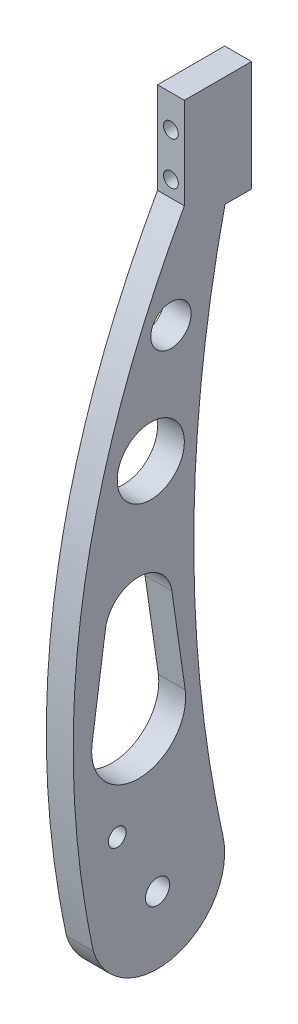
ISO-10303-21;
HEADER;
FILE_DESCRIPTION(('STEP AP214'),'2;1');
FILE_NAME('part.step','',(''),(''),'','','');
FILE_SCHEMA(('AUTOMOTIVE_DESIGN { 1 0 10303 214 1 1 1 1 }'));
ENDSEC;
DATA;
#1=APPLICATION_CONTEXT('core data for automotive mechanical design processes');
#2=APPLICATION_PROTOCOL_DEFINITION('international standard','automotive_design',2000,#1);
#3=PRODUCT_CONTEXT('',#1,'mechanical');
#4=PRODUCT('Part','Part','',(#3));
#5=PRODUCT_RELATED_PRODUCT_CATEGORY('part','',(#4));
#6=PRODUCT_DEFINITION_FORMATION('','',#4);
#7=PRODUCT_DEFINITION_CONTEXT('part definition',#1,'design');
#8=PRODUCT_DEFINITION('design','',#6,#7);
#9=PRODUCT_DEFINITION_SHAPE('','',#8);
#10=(LENGTH_UNIT() NAMED_UNIT(*) SI_UNIT(.MILLI.,.METRE.));
#11=(NAMED_UNIT(*) PLANE_ANGLE_UNIT() SI_UNIT($,.RADIAN.));
#12=(NAMED_UNIT(*) SI_UNIT($,.STERADIAN.) SOLID_ANGLE_UNIT());
#13=UNCERTAINTY_MEASURE_WITH_UNIT(LENGTH_MEASURE(1.E-05),#10,'distance_accuracy_value','');
#14=(GEOMETRIC_REPRESENTATION_CONTEXT(3) GLOBAL_UNCERTAINTY_ASSIGNED_CONTEXT((#13)) GLOBAL_UNIT_ASSIGNED_CONTEXT((#10,
#11,#12)) REPRESENTATION_CONTEXT('',''));
#15=CARTESIAN_POINT('',(0.,0.,0.));
#16=DIRECTION('',(0.,0.,1.));
#17=DIRECTION('',(1.,0.,0.));
#18=AXIS2_PLACEMENT_3D('',#15,#16,#17);
#19=CARTESIAN_POINT('',(0.,107.239018535757,27.9707283899343));
#20=DIRECTION('',(1.,0.,0.));
#21=DIRECTION('',(0.,0.,-1.));
#22=AXIS2_PLACEMENT_3D('',#19,#20,#21);
#23=PLANE('',#22);
#24=CARTESIAN_POINT('',(0.,0.,0.));
#25=DIRECTION('',(1.,0.,0.));
#26=DIRECTION('',(0.,0.,-1.));
#27=AXIS2_PLACEMENT_3D('',#24,#25,#26);
#28=CIRCLE('',#27,4.49999999999999);
#29=CARTESIAN_POINT('',(0.,0.,-4.49999999999999));
#30=VERTEX_POINT('',#29);
#31=EDGE_CURVE('E301',#30,#30,#28,.T.);
#32=ORIENTED_EDGE('',*,*,#31,.T.);
#33=EDGE_LOOP('',(#32));
#34=FACE_BOUND('',#33,.T.);
#35=DIRECTION('',(0.,0.,1.));
#36=VECTOR('',#35,1.);
#37=CARTESIAN_POINT('',(0.,250.,-10.));
#38=LINE('',#37,#36);
#39=CARTESIAN_POINT('',(0.,250.,-35.));
#40=VERTEX_POINT('',#39);
#41=CARTESIAN_POINT('',(0.,250.,-10.));
#42=VERTEX_POINT('',#41);
#43=EDGE_CURVE('E136',#40,#42,#38,.T.);
#44=ORIENTED_EDGE('',*,*,#43,.F.);
#45=DIRECTION('',(0.,1.,0.));
#46=VECTOR('',#45,1.);
#47=CARTESIAN_POINT('',(0.,208.897946032526,-35.));
#48=LINE('',#47,#46);
#49=CARTESIAN_POINT('',(0.,208.897946032526,-35.));
#50=VERTEX_POINT('',#49);
#51=EDGE_CURVE('E163',#50,#40,#48,.T.);
#52=ORIENTED_EDGE('',*,*,#51,.F.);
#53=DIRECTION('',(0.,0.,-1.));
#54=VECTOR('',#53,1.);
#55=CARTESIAN_POINT('',(0.,208.897946032526,-25.1229643170488));
#56=LINE('',#55,#54);
#57=CARTESIAN_POINT('',(0.,208.897946032526,-25.1229643170489));
#58=VERTEX_POINT('',#57);
#59=EDGE_CURVE('E229',#58,#50,#56,.T.);
#60=ORIENTED_EDGE('',*,*,#59,.F.);
#61=CARTESIAN_POINT('',(0.,105.556538038676,-478.94465908181));
#62=DIRECTION('',(-1.,0.,0.));
#63=DIRECTION('',(0.,0.,1.));
#64=AXIS2_PLACEMENT_3D('',#61,#62,#63);
#65=CIRCLE('',#64,465.439123028256);
#66=CARTESIAN_POINT('',(0.,5.51026983738115,-24.3851784147512));
#67=VERTEX_POINT('',#66);
#68=EDGE_CURVE('E220',#67,#58,#65,.T.);
#69=ORIENTED_EDGE('',*,*,#68,.F.);
#70=CARTESIAN_POINT('',(0.,0.,0.));
#71=DIRECTION('',(1.,0.,0.));
#72=DIRECTION('',(0.,0.,-1.));
#73=AXIS2_PLACEMENT_3D('',#70,#71,#72);
#74=CIRCLE('',#73,25.);
#75=CARTESIAN_POINT('',(0.,-7.32587747634419,23.9025421075164));
#76=VERTEX_POINT('',#75);
#77=EDGE_CURVE('E230',#76,#67,#74,.T.);
#78=ORIENTED_EDGE('',*,*,#77,.F.);
#79=CARTESIAN_POINT('',(0.,215.979685496881,-10.));
#80=CARTESIAN_POINT('',(0.,110.151133061246,48.9901857261103));
#81=CARTESIAN_POINT('',(0.,-7.32587747634419,23.9025421075164));
#82=B_SPLINE_CURVE_WITH_KNOTS('',2,(#79,#80,#81),.UNSPECIFIED.,.F.,.F.,(3,3),(0.,1.),.UNSPECIFIED.);
#83=CARTESIAN_POINT('',(0.,215.979685496881,-10.));
#84=VERTEX_POINT('',#83);
#85=EDGE_CURVE('E257',#84,#76,#82,.T.);
#86=ORIENTED_EDGE('',*,*,#85,.F.);
#87=DIRECTION('',(0.,-1.,0.));
#88=VECTOR('',#87,1.);
#89=CARTESIAN_POINT('',(0.,215.979685496881,-10.));
#90=LINE('',#89,#88);
#91=EDGE_CURVE('E261',#42,#84,#90,.T.);
#92=ORIENTED_EDGE('',*,*,#91,.F.);
#93=EDGE_LOOP('',(#44,#52,#60,#69,#78,#86,#92));
#94=FACE_BOUND('',#93,.T.);
#95=CARTESIAN_POINT('',(0.,57.3667162252013,7.01844159044462));
#96=DIRECTION('',(1.,0.,0.));
#97=DIRECTION('',(0.,0.,-1.));
#98=AXIS2_PLACEMENT_3D('',#95,#96,#97);
#99=CIRCLE('',#98,17.5);
#100=CARTESIAN_POINT('',(0.,59.8667162252013,24.3389496661334));
#101=VERTEX_POINT('',#100);
#102=CARTESIAN_POINT('',(0.,59.8667162252013,-10.3020664852442));
#103=VERTEX_POINT('',#102);
#104=EDGE_CURVE('E60',#101,#103,#99,.T.);
#105=ORIENTED_EDGE('',*,*,#104,.T.);
#106=DIRECTION('',(0.,0.989743318610787,0.142857142857143));
#107=VECTOR('',#106,1.);
#108=CARTESIAN_POINT('',(0.,94.1524305109156,-5.35334989219021));
#109=LINE('',#108,#107);
#110=CARTESIAN_POINT('',(0.,94.1524305109156,-5.35334989219021));
#111=VERTEX_POINT('',#110);
#112=EDGE_CURVE('E135',#103,#111,#109,.T.);
#113=ORIENTED_EDGE('',*,*,#112,.T.);
#114=CARTESIAN_POINT('',(0.,92.3667162252013,7.01844159044462));
#115=DIRECTION('',(1.,0.,0.));
#116=DIRECTION('',(0.,0.,-1.));
#117=AXIS2_PLACEMENT_3D('',#114,#115,#116);
#118=CIRCLE('',#117,12.5);
#119=CARTESIAN_POINT('',(0.,94.1524305109156,19.3902330730795));
#120=VERTEX_POINT('',#119);
#121=EDGE_CURVE('E152',#111,#120,#118,.T.);
#122=ORIENTED_EDGE('',*,*,#121,.T.);
#123=DIRECTION('',(0.,-0.989743318610787,0.142857142857143));
#124=VECTOR('',#123,1.);
#125=CARTESIAN_POINT('',(0.,59.8667162252013,24.3389496661334));
#126=LINE('',#125,#124);
#127=EDGE_CURVE('E129',#120,#101,#126,.T.);
#128=ORIENTED_EDGE('',*,*,#127,.T.);
#129=EDGE_LOOP('',(#105,#113,#122,#128));
#130=FACE_BOUND('',#129,.T.);
#131=CARTESIAN_POINT('',(0.,180.,-5.00000000000001));
#132=DIRECTION('',(1.,0.,0.));
#133=DIRECTION('',(0.,0.,-1.));
#134=AXIS2_PLACEMENT_3D('',#131,#132,#133);
#135=CIRCLE('',#134,7.5);
#136=CARTESIAN_POINT('',(0.,180.,-12.5));
#137=VERTEX_POINT('',#136);
#138=EDGE_CURVE('E284',#137,#137,#135,.T.);
#139=ORIENTED_EDGE('',*,*,#138,.T.);
#140=EDGE_LOOP('',(#139));
#141=FACE_BOUND('',#140,.T.);
#142=CARTESIAN_POINT('',(0.,140.,2.5));
#143=DIRECTION('',(1.,0.,0.));
#144=DIRECTION('',(0.,0.,-1.));
#145=AXIS2_PLACEMENT_3D('',#142,#143,#144);
#146=CIRCLE('',#145,12.5);
#147=CARTESIAN_POINT('',(0.,140.,-10.));
#148=VERTEX_POINT('',#147);
#149=EDGE_CURVE('E288',#148,#148,#146,.T.);
#150=ORIENTED_EDGE('',*,*,#149,.T.);
#151=EDGE_LOOP('',(#150));
#152=FACE_BOUND('',#151,.T.);
#153=CARTESIAN_POINT('',(0.,25.,15.));
#154=DIRECTION('',(-1.,0.,0.));
#155=DIRECTION('',(0.,0.,1.));
#156=AXIS2_PLACEMENT_3D('',#153,#154,#155);
#157=CIRCLE('',#156,3.3);
#158=CARTESIAN_POINT('',(0.,25.,18.3));
#159=VERTEX_POINT('',#158);
#160=EDGE_CURVE('E291',#159,#159,#157,.T.);
#161=ORIENTED_EDGE('',*,*,#160,.F.);
#162=EDGE_LOOP('',(#161));
#163=FACE_BOUND('',#162,.T.);
#164=ADVANCED_FACE('F37',(#34,#94,#130,#141,#152,#163),#23,.F.);
#165=CARTESIAN_POINT('',(10.,107.239018535757,27.9707283899343));
#166=DIRECTION('',(1.,0.,0.));
#167=DIRECTION('',(0.,0.,-1.));
#168=AXIS2_PLACEMENT_3D('',#165,#166,#167);
#169=PLANE('',#168);
#170=CARTESIAN_POINT('',(10.,25.,15.));
#171=DIRECTION('',(1.,0.,0.));
#172=DIRECTION('',(0.,0.,-1.));
#173=AXIS2_PLACEMENT_3D('',#170,#171,#172);
#174=CIRCLE('',#173,3.3);
#175=CARTESIAN_POINT('',(10.,25.,11.7));
#176=VERTEX_POINT('',#175);
#177=EDGE_CURVE('E293',#176,#176,#174,.T.);
#178=ORIENTED_EDGE('',*,*,#177,.F.);
#179=EDGE_LOOP('',(#178));
#180=FACE_BOUND('',#179,.T.);
#181=CARTESIAN_POINT('',(10.,0.,0.));
#182=DIRECTION('',(1.,0.,0.));
#183=DIRECTION('',(0.,0.,-1.));
#184=AXIS2_PLACEMENT_3D('',#181,#182,#183);
#185=CIRCLE('',#184,4.49999999999999);
#186=CARTESIAN_POINT('',(10.,0.,-4.49999999999999));
#187=VERTEX_POINT('',#186);
#188=EDGE_CURVE('E296',#187,#187,#185,.T.);
#189=ORIENTED_EDGE('',*,*,#188,.F.);
#190=EDGE_LOOP('',(#189));
#191=FACE_BOUND('',#190,.T.);
#192=CARTESIAN_POINT('',(10.,180.,-5.00000000000001));
#193=DIRECTION('',(1.,0.,0.));
#194=DIRECTION('',(0.,0.,-1.));
#195=AXIS2_PLACEMENT_3D('',#192,#193,#194);
#196=CIRCLE('',#195,7.5);
#197=CARTESIAN_POINT('',(10.,180.,-12.5));
#198=VERTEX_POINT('',#197);
#199=EDGE_CURVE('E150',#198,#198,#196,.T.);
#200=ORIENTED_EDGE('',*,*,#199,.F.);
#201=EDGE_LOOP('',(#200));
#202=FACE_BOUND('',#201,.T.);
#203=DIRECTION('',(0.,0.,1.));
#204=VECTOR('',#203,1.);
#205=CARTESIAN_POINT('',(10.,250.,-35.));
#206=LINE('',#205,#204);
#207=CARTESIAN_POINT('',(10.,250.,-35.));
#208=VERTEX_POINT('',#207);
#209=CARTESIAN_POINT('',(10.,250.,-10.));
#210=VERTEX_POINT('',#209);
#211=EDGE_CURVE('E160',#208,#210,#206,.T.);
#212=ORIENTED_EDGE('',*,*,#211,.T.);
#213=DIRECTION('',(0.,-1.,0.));
#214=VECTOR('',#213,1.);
#215=CARTESIAN_POINT('',(10.,215.979685496881,-10.));
#216=LINE('',#215,#214);
#217=CARTESIAN_POINT('',(10.,215.979685496881,-10.));
#218=VERTEX_POINT('',#217);
#219=EDGE_CURVE('E162',#210,#218,#216,.T.);
#220=ORIENTED_EDGE('',*,*,#219,.T.);
#221=CARTESIAN_POINT('',(10.,215.979685496881,-10.));
#222=CARTESIAN_POINT('',(10.,110.151133061246,48.9901857261103));
#223=CARTESIAN_POINT('',(10.,-7.32587747634419,23.9025421075164));
#224=B_SPLINE_CURVE_WITH_KNOTS('',2,(#221,#222,#223),.UNSPECIFIED.,.F.,.F.,(3,3),(0.,1.),.UNSPECIFIED.);
#225=CARTESIAN_POINT('',(10.,-7.32587747634419,23.9025421075164));
#226=VERTEX_POINT('',#225);
#227=EDGE_CURVE('E165',#218,#226,#224,.T.);
#228=ORIENTED_EDGE('',*,*,#227,.T.);
#229=CARTESIAN_POINT('',(10.,0.,0.));
#230=DIRECTION('',(1.,0.,0.));
#231=DIRECTION('',(0.,0.,-1.));
#232=AXIS2_PLACEMENT_3D('',#229,#230,#231);
#233=CIRCLE('',#232,25.);
#234=CARTESIAN_POINT('',(10.,5.51026983738115,-24.3851784147512));
#235=VERTEX_POINT('',#234);
#236=EDGE_CURVE('E170',#226,#235,#233,.T.);
#237=ORIENTED_EDGE('',*,*,#236,.T.);
#238=CARTESIAN_POINT('',(10.,105.556538038676,-478.94465908181));
#239=DIRECTION('',(-1.,0.,0.));
#240=DIRECTION('',(0.,0.,1.));
#241=AXIS2_PLACEMENT_3D('',#238,#239,#240);
#242=CIRCLE('',#241,465.439123028256);
#243=CARTESIAN_POINT('',(10.,208.897946032526,-25.1229643170489));
#244=VERTEX_POINT('',#243);
#245=EDGE_CURVE('E272',#235,#244,#242,.T.);
#246=ORIENTED_EDGE('',*,*,#245,.T.);
#247=DIRECTION('',(0.,0.,-1.));
#248=VECTOR('',#247,1.);
#249=CARTESIAN_POINT('',(10.,208.897946032526,-25.1229643170488));
#250=LINE('',#249,#248);
#251=CARTESIAN_POINT('',(10.,208.897946032526,-35.));
#252=VERTEX_POINT('',#251);
#253=EDGE_CURVE('E234',#244,#252,#250,.T.);
#254=ORIENTED_EDGE('',*,*,#253,.T.);
#255=DIRECTION('',(0.,1.,0.));
#256=VECTOR('',#255,1.);
#257=CARTESIAN_POINT('',(10.,208.897946032526,-35.));
#258=LINE('',#257,#256);
#259=EDGE_CURVE('E247',#252,#208,#258,.T.);
#260=ORIENTED_EDGE('',*,*,#259,.T.);
#261=EDGE_LOOP('',(#212,#220,#228,#237,#246,#254,#260));
#262=FACE_BOUND('',#261,.T.);
#263=DIRECTION('',(0.,0.989743318610787,0.142857142857143));
#264=VECTOR('',#263,1.);
#265=CARTESIAN_POINT('',(10.,94.1524305109156,-5.35334989219021));
#266=LINE('',#265,#264);
#267=CARTESIAN_POINT('',(10.,59.8667162252013,-10.3020664852442));
#268=VERTEX_POINT('',#267);
#269=CARTESIAN_POINT('',(10.,94.1524305109156,-5.35334989219021));
#270=VERTEX_POINT('',#269);
#271=EDGE_CURVE('E128',#268,#270,#266,.T.);
#272=ORIENTED_EDGE('',*,*,#271,.F.);
#273=CARTESIAN_POINT('',(10.,57.3667162252013,7.01844159044462));
#274=DIRECTION('',(1.,0.,0.));
#275=DIRECTION('',(0.,0.,-1.));
#276=AXIS2_PLACEMENT_3D('',#273,#274,#275);
#277=CIRCLE('',#276,17.5);
#278=CARTESIAN_POINT('',(10.,59.8667162252013,24.3389496661334));
#279=VERTEX_POINT('',#278);
#280=EDGE_CURVE('E120',#279,#268,#277,.T.);
#281=ORIENTED_EDGE('',*,*,#280,.F.);
#282=DIRECTION('',(0.,-0.989743318610787,0.142857142857143));
#283=VECTOR('',#282,1.);
#284=CARTESIAN_POINT('',(10.,59.8667162252013,24.3389496661334));
#285=LINE('',#284,#283);
#286=CARTESIAN_POINT('',(10.,94.1524305109156,19.3902330730795));
#287=VERTEX_POINT('',#286);
#288=EDGE_CURVE('E144',#287,#279,#285,.T.);
#289=ORIENTED_EDGE('',*,*,#288,.F.);
#290=CARTESIAN_POINT('',(10.,92.3667162252013,7.01844159044462));
#291=DIRECTION('',(1.,0.,0.));
#292=DIRECTION('',(0.,0.,-1.));
#293=AXIS2_PLACEMENT_3D('',#290,#291,#292);
#294=CIRCLE('',#293,12.5);
#295=EDGE_CURVE('E142',#270,#287,#294,.T.);
#296=ORIENTED_EDGE('',*,*,#295,.F.);
#297=EDGE_LOOP('',(#272,#281,#289,#296));
#298=FACE_BOUND('',#297,.T.);
#299=CARTESIAN_POINT('',(10.,140.,2.5));
#300=DIRECTION('',(1.,0.,0.));
#301=DIRECTION('',(0.,0.,-1.));
#302=AXIS2_PLACEMENT_3D('',#299,#300,#301);
#303=CIRCLE('',#302,12.5);
#304=CARTESIAN_POINT('',(10.,140.,-10.));
#305=VERTEX_POINT('',#304);
#306=EDGE_CURVE('E314',#305,#305,#303,.T.);
#307=ORIENTED_EDGE('',*,*,#306,.F.);
#308=EDGE_LOOP('',(#307));
#309=FACE_BOUND('',#308,.T.);
#310=ADVANCED_FACE('F140',(#180,#191,#202,#262,#298,#309),#169,.T.);
#311=CARTESIAN_POINT('',(10.,250.,-10.));
#312=DIRECTION('',(0.,-1.,0.));
#313=DIRECTION('',(0.,0.,-1.));
#314=AXIS2_PLACEMENT_3D('',#311,#312,#313);
#315=PLANE('',#314);
#316=ORIENTED_EDGE('',*,*,#43,.T.);
#317=DIRECTION('',(-1.,0.,0.));
#318=VECTOR('',#317,1.);
#319=CARTESIAN_POINT('',(10.,250.,-10.));
#320=LINE('',#319,#318);
#321=EDGE_CURVE('E11',#210,#42,#320,.T.);
#322=ORIENTED_EDGE('',*,*,#321,.F.);
#323=ORIENTED_EDGE('',*,*,#211,.F.);
#324=DIRECTION('',(-1.,0.,0.));
#325=VECTOR('',#324,1.);
#326=CARTESIAN_POINT('',(10.,250.,-35.));
#327=LINE('',#326,#325);
#328=EDGE_CURVE('E244',#208,#40,#327,.T.);
#329=ORIENTED_EDGE('',*,*,#328,.T.);
#330=EDGE_LOOP('',(#316,#322,#323,#329));
#331=FACE_BOUND('',#330,.T.);
#332=ADVANCED_FACE('F39',(#331),#315,.F.);
#333=CARTESIAN_POINT('',(10.,215.979685496881,-10.));
#334=DIRECTION('',(0.,0.,-1.));
#335=DIRECTION('',(-1.,0.,0.));
#336=AXIS2_PLACEMENT_3D('',#333,#334,#335);
#337=PLANE('',#336);
#338=CARTESIAN_POINT('',(4.98385200999962,238.,-10.));
#339=DIRECTION('',(0.,0.,-1.));
#340=DIRECTION('',(-1.,0.,0.));
#341=AXIS2_PLACEMENT_3D('',#338,#339,#340);
#342=CIRCLE('',#341,2.74999999999999);
#343=CARTESIAN_POINT('',(2.23385200999963,238.,-10.));
#344=VERTEX_POINT('',#343);
#345=EDGE_CURVE('E306',#344,#344,#342,.T.);
#346=ORIENTED_EDGE('',*,*,#345,.T.);
#347=EDGE_LOOP('',(#346));
#348=FACE_BOUND('',#347,.T.);
#349=CARTESIAN_POINT('',(4.98385200999962,222.,-10.));
#350=DIRECTION('',(0.,0.,-1.));
#351=DIRECTION('',(-1.,0.,0.));
#352=AXIS2_PLACEMENT_3D('',#349,#350,#351);
#353=CIRCLE('',#352,2.74999999999999);
#354=CARTESIAN_POINT('',(2.23385200999963,222.,-10.));
#355=VERTEX_POINT('',#354);
#356=EDGE_CURVE('E311',#355,#355,#353,.T.);
#357=ORIENTED_EDGE('',*,*,#356,.T.);
#358=EDGE_LOOP('',(#357));
#359=FACE_BOUND('',#358,.T.);
#360=ORIENTED_EDGE('',*,*,#91,.T.);
#361=DIRECTION('',(-1.,0.,0.));
#362=VECTOR('',#361,1.);
#363=CARTESIAN_POINT('',(10.,215.979685496881,-10.));
#364=LINE('',#363,#362);
#365=EDGE_CURVE('E45',#218,#84,#364,.T.);
#366=ORIENTED_EDGE('',*,*,#365,.F.);
#367=ORIENTED_EDGE('',*,*,#219,.F.);
#368=ORIENTED_EDGE('',*,*,#321,.T.);
#369=EDGE_LOOP('',(#360,#366,#367,#368));
#370=FACE_BOUND('',#369,.T.);
#371=ADVANCED_FACE('F180',(#348,#359,#370),#337,.F.);
#372=DIRECTION('',(-1.,0.,0.));
#373=VECTOR('',#372,1.);
#374=SURFACE_OF_LINEAR_EXTRUSION('',#224,#373);
#375=ORIENTED_EDGE('',*,*,#85,.T.);
#376=DIRECTION('',(-1.,0.,0.));
#377=VECTOR('',#376,1.);
#378=CARTESIAN_POINT('',(10.,-7.32587747634419,23.9025421075164));
#379=LINE('',#378,#377);
#380=EDGE_CURVE('E250',#226,#76,#379,.T.);
#381=ORIENTED_EDGE('',*,*,#380,.F.);
#382=ORIENTED_EDGE('',*,*,#227,.F.);
#383=ORIENTED_EDGE('',*,*,#365,.T.);
#384=EDGE_LOOP('',(#375,#381,#382,#383));
#385=FACE_BOUND('',#384,.T.);
#386=ADVANCED_FACE('F176',(#385),#374,.F.);
#387=CARTESIAN_POINT('',(10.,0.,0.));
#388=DIRECTION('',(-1.,0.,0.));
#389=DIRECTION('',(0.,0.,1.));
#390=AXIS2_PLACEMENT_3D('',#387,#388,#389);
#391=CYLINDRICAL_SURFACE('',#390,25.);
#392=ORIENTED_EDGE('',*,*,#77,.T.);
#393=DIRECTION('',(-1.,0.,0.));
#394=VECTOR('',#393,1.);
#395=CARTESIAN_POINT('',(10.,5.51026983738115,-24.3851784147512));
#396=LINE('',#395,#394);
#397=EDGE_CURVE('E226',#235,#67,#396,.T.);
#398=ORIENTED_EDGE('',*,*,#397,.F.);
#399=ORIENTED_EDGE('',*,*,#236,.F.);
#400=ORIENTED_EDGE('',*,*,#380,.T.);
#401=EDGE_LOOP('',(#392,#398,#399,#400));
#402=FACE_BOUND('',#401,.T.);
#403=ADVANCED_FACE('F179',(#402),#391,.T.);
#404=CARTESIAN_POINT('',(10.,105.556538038676,-478.94465908181));
#405=DIRECTION('',(-1.,0.,0.));
#406=DIRECTION('',(0.,0.,1.));
#407=AXIS2_PLACEMENT_3D('',#404,#405,#406);
#408=CYLINDRICAL_SURFACE('',#407,465.439123028256);
#409=ORIENTED_EDGE('',*,*,#68,.T.);
#410=DIRECTION('',(-1.,0.,0.));
#411=VECTOR('',#410,1.);
#412=CARTESIAN_POINT('',(10.,208.897946032526,-25.1229643170489));
#413=LINE('',#412,#411);
#414=EDGE_CURVE('E223',#244,#58,#413,.T.);
#415=ORIENTED_EDGE('',*,*,#414,.F.);
#416=ORIENTED_EDGE('',*,*,#245,.F.);
#417=ORIENTED_EDGE('',*,*,#397,.T.);
#418=EDGE_LOOP('',(#409,#415,#416,#417));
#419=FACE_BOUND('',#418,.T.);
#420=ADVANCED_FACE('F209',(#419),#408,.F.);
#421=CARTESIAN_POINT('',(10.,208.897946032526,-25.1229643170488));
#422=DIRECTION('',(0.,1.,0.));
#423=DIRECTION('',(0.,0.,1.));
#424=AXIS2_PLACEMENT_3D('',#421,#422,#423);
#425=PLANE('',#424);
#426=ORIENTED_EDGE('',*,*,#59,.T.);
#427=DIRECTION('',(-1.,0.,0.));
#428=VECTOR('',#427,1.);
#429=CARTESIAN_POINT('',(10.,208.897946032526,-35.));
#430=LINE('',#429,#428);
#431=EDGE_CURVE('E235',#252,#50,#430,.T.);
#432=ORIENTED_EDGE('',*,*,#431,.F.);
#433=ORIENTED_EDGE('',*,*,#253,.F.);
#434=ORIENTED_EDGE('',*,*,#414,.T.);
#435=EDGE_LOOP('',(#426,#432,#433,#434));
#436=FACE_BOUND('',#435,.T.);
#437=ADVANCED_FACE('F206',(#436),#425,.F.);
#438=CARTESIAN_POINT('',(10.,208.897946032526,-35.));
#439=DIRECTION('',(0.,0.,1.));
#440=DIRECTION('',(1.,0.,0.));
#441=AXIS2_PLACEMENT_3D('',#438,#439,#440);
#442=PLANE('',#441);
#443=CARTESIAN_POINT('',(4.98385200999962,238.,-35.));
#444=DIRECTION('',(0.,0.,-1.));
#445=DIRECTION('',(-1.,0.,0.));
#446=AXIS2_PLACEMENT_3D('',#443,#444,#445);
#447=CIRCLE('',#446,2.74999999999999);
#448=CARTESIAN_POINT('',(2.23385200999963,238.,-35.));
#449=VERTEX_POINT('',#448);
#450=EDGE_CURVE('E303',#449,#449,#447,.T.);
#451=ORIENTED_EDGE('',*,*,#450,.F.);
#452=EDGE_LOOP('',(#451));
#453=FACE_BOUND('',#452,.T.);
#454=CARTESIAN_POINT('',(4.98385200999962,222.,-35.));
#455=DIRECTION('',(0.,0.,-1.));
#456=DIRECTION('',(-1.,0.,0.));
#457=AXIS2_PLACEMENT_3D('',#454,#455,#456);
#458=CIRCLE('',#457,2.74999999999999);
#459=CARTESIAN_POINT('',(2.23385200999963,222.,-35.));
#460=VERTEX_POINT('',#459);
#461=EDGE_CURVE('E308',#460,#460,#458,.T.);
#462=ORIENTED_EDGE('',*,*,#461,.F.);
#463=EDGE_LOOP('',(#462));
#464=FACE_BOUND('',#463,.T.);
#465=ORIENTED_EDGE('',*,*,#51,.T.);
#466=ORIENTED_EDGE('',*,*,#328,.F.);
#467=ORIENTED_EDGE('',*,*,#259,.F.);
#468=ORIENTED_EDGE('',*,*,#431,.T.);
#469=EDGE_LOOP('',(#465,#466,#467,#468));
#470=FACE_BOUND('',#469,.T.);
#471=ADVANCED_FACE('F203',(#453,#464,#470),#442,.F.);
#472=CARTESIAN_POINT('',(10.,57.3667162252013,7.01844159044462));
#473=DIRECTION('',(-1.,0.,0.));
#474=DIRECTION('',(0.,0.,1.));
#475=AXIS2_PLACEMENT_3D('',#472,#473,#474);
#476=CYLINDRICAL_SURFACE('',#475,17.5);
#477=ORIENTED_EDGE('',*,*,#104,.F.);
#478=DIRECTION('',(-1.,0.,0.));
#479=VECTOR('',#478,1.);
#480=CARTESIAN_POINT('',(10.,59.8667162252013,24.3389496661334));
#481=LINE('',#480,#479);
#482=EDGE_CURVE('E124',#279,#101,#481,.T.);
#483=ORIENTED_EDGE('',*,*,#482,.F.);
#484=ORIENTED_EDGE('',*,*,#280,.T.);
#485=DIRECTION('',(-1.,0.,0.));
#486=VECTOR('',#485,1.);
#487=CARTESIAN_POINT('',(10.,59.8667162252013,-10.3020664852442));
#488=LINE('',#487,#486);
#489=EDGE_CURVE('E123',#268,#103,#488,.T.);
#490=ORIENTED_EDGE('',*,*,#489,.T.);
#491=EDGE_LOOP('',(#477,#483,#484,#490));
#492=FACE_BOUND('',#491,.T.);
#493=ADVANCED_FACE('F122',(#492),#476,.F.);
#494=CARTESIAN_POINT('',(10.,94.1524305109156,-5.35334989219021));
#495=DIRECTION('',(0.,-0.142857142857143,0.989743318610787));
#496=DIRECTION('',(0.,-0.989743318610787,-0.142857142857143));
#497=AXIS2_PLACEMENT_3D('',#494,#495,#496);
#498=PLANE('',#497);
#499=ORIENTED_EDGE('',*,*,#112,.F.);
#500=ORIENTED_EDGE('',*,*,#489,.F.);
#501=ORIENTED_EDGE('',*,*,#271,.T.);
#502=DIRECTION('',(-1.,0.,0.));
#503=VECTOR('',#502,1.);
#504=CARTESIAN_POINT('',(10.,94.1524305109156,-5.35334989219021));
#505=LINE('',#504,#503);
#506=EDGE_CURVE('E137',#270,#111,#505,.T.);
#507=ORIENTED_EDGE('',*,*,#506,.T.);
#508=EDGE_LOOP('',(#499,#500,#501,#507));
#509=FACE_BOUND('',#508,.T.);
#510=ADVANCED_FACE('F132',(#509),#498,.T.);
#511=CARTESIAN_POINT('',(10.,92.3667162252013,7.01844159044462));
#512=DIRECTION('',(-1.,0.,0.));
#513=DIRECTION('',(0.,0.,1.));
#514=AXIS2_PLACEMENT_3D('',#511,#512,#513);
#515=CYLINDRICAL_SURFACE('',#514,12.5);
#516=ORIENTED_EDGE('',*,*,#121,.F.);
#517=ORIENTED_EDGE('',*,*,#506,.F.);
#518=ORIENTED_EDGE('',*,*,#295,.T.);
#519=DIRECTION('',(-1.,0.,0.));
#520=VECTOR('',#519,1.);
#521=CARTESIAN_POINT('',(10.,94.1524305109156,19.3902330730795));
#522=LINE('',#521,#520);
#523=EDGE_CURVE('E52',#287,#120,#522,.T.);
#524=ORIENTED_EDGE('',*,*,#523,.T.);
#525=EDGE_LOOP('',(#516,#517,#518,#524));
#526=FACE_BOUND('',#525,.T.);
#527=ADVANCED_FACE('F335',(#526),#515,.F.);
#528=CARTESIAN_POINT('',(10.,59.8667162252013,24.3389496661334));
#529=DIRECTION('',(0.,-0.142857142857143,-0.989743318610787));
#530=DIRECTION('',(0.,0.989743318610787,-0.142857142857143));
#531=AXIS2_PLACEMENT_3D('',#528,#529,#530);
#532=PLANE('',#531);
#533=ORIENTED_EDGE('',*,*,#127,.F.);
#534=ORIENTED_EDGE('',*,*,#523,.F.);
#535=ORIENTED_EDGE('',*,*,#288,.T.);
#536=ORIENTED_EDGE('',*,*,#482,.T.);
#537=EDGE_LOOP('',(#533,#534,#535,#536));
#538=FACE_BOUND('',#537,.T.);
#539=ADVANCED_FACE('F326',(#538),#532,.T.);
#540=CARTESIAN_POINT('',(10.,180.,-5.00000000000001));
#541=DIRECTION('',(-1.,0.,0.));
#542=DIRECTION('',(0.,0.,1.));
#543=AXIS2_PLACEMENT_3D('',#540,#541,#542);
#544=CYLINDRICAL_SURFACE('',#543,7.5);
#545=ORIENTED_EDGE('',*,*,#199,.T.);
#546=EDGE_LOOP('',(#545));
#547=FACE_BOUND('',#546,.T.);
#548=ORIENTED_EDGE('',*,*,#138,.F.);
#549=EDGE_LOOP('',(#548));
#550=FACE_BOUND('',#549,.T.);
#551=ADVANCED_FACE('F321',(#547,#550),#544,.F.);
#552=CARTESIAN_POINT('',(10.,140.,2.5));
#553=DIRECTION('',(-1.,0.,0.));
#554=DIRECTION('',(0.,0.,1.));
#555=AXIS2_PLACEMENT_3D('',#552,#553,#554);
#556=CYLINDRICAL_SURFACE('',#555,12.5);
#557=ORIENTED_EDGE('',*,*,#306,.T.);
#558=EDGE_LOOP('',(#557));
#559=FACE_BOUND('',#558,.T.);
#560=ORIENTED_EDGE('',*,*,#149,.F.);
#561=EDGE_LOOP('',(#560));
#562=FACE_BOUND('',#561,.T.);
#563=ADVANCED_FACE('F325',(#559,#562),#556,.F.);
#564=CARTESIAN_POINT('',(4.98385200999962,222.,-35.));
#565=DIRECTION('',(0.,0.,-1.));
#566=DIRECTION('',(-1.,0.,0.));
#567=AXIS2_PLACEMENT_3D('',#564,#565,#566);
#568=CYLINDRICAL_SURFACE('',#567,2.74999999999999);
#569=ORIENTED_EDGE('',*,*,#461,.T.);
#570=EDGE_LOOP('',(#569));
#571=FACE_BOUND('',#570,.T.);
#572=ORIENTED_EDGE('',*,*,#356,.F.);
#573=EDGE_LOOP('',(#572));
#574=FACE_BOUND('',#573,.T.);
#575=ADVANCED_FACE('F332',(#571,#574),#568,.F.);
#576=CARTESIAN_POINT('',(4.98385200999962,238.,-35.));
#577=DIRECTION('',(0.,0.,-1.));
#578=DIRECTION('',(-1.,0.,0.));
#579=AXIS2_PLACEMENT_3D('',#576,#577,#578);
#580=CYLINDRICAL_SURFACE('',#579,2.74999999999999);
#581=ORIENTED_EDGE('',*,*,#450,.T.);
#582=EDGE_LOOP('',(#581));
#583=FACE_BOUND('',#582,.T.);
#584=ORIENTED_EDGE('',*,*,#345,.F.);
#585=EDGE_LOOP('',(#584));
#586=FACE_BOUND('',#585,.T.);
#587=ADVANCED_FACE('F391',(#583,#586),#580,.F.);
#588=CARTESIAN_POINT('',(10.,0.,0.));
#589=DIRECTION('',(1.,0.,0.));
#590=DIRECTION('',(0.,0.,-1.));
#591=AXIS2_PLACEMENT_3D('',#588,#589,#590);
#592=CYLINDRICAL_SURFACE('',#591,4.49999999999999);
#593=ORIENTED_EDGE('',*,*,#188,.T.);
#594=EDGE_LOOP('',(#593));
#595=FACE_BOUND('',#594,.T.);
#596=ORIENTED_EDGE('',*,*,#31,.F.);
#597=EDGE_LOOP('',(#596));
#598=FACE_BOUND('',#597,.T.);
#599=ADVANCED_FACE('F400',(#595,#598),#592,.F.);
#600=CARTESIAN_POINT('',(0.,25.,15.));
#601=DIRECTION('',(-1.,0.,0.));
#602=DIRECTION('',(0.,0.,1.));
#603=AXIS2_PLACEMENT_3D('',#600,#601,#602);
#604=CYLINDRICAL_SURFACE('',#603,3.3);
#605=ORIENTED_EDGE('',*,*,#177,.T.);
#606=EDGE_LOOP('',(#605));
#607=FACE_BOUND('',#606,.T.);
#608=ORIENTED_EDGE('',*,*,#160,.T.);
#609=EDGE_LOOP('',(#608));
#610=FACE_BOUND('',#609,.T.);
#611=ADVANCED_FACE('F409',(#607,#610),#604,.F.);
#612=CLOSED_SHELL('',(#164,#310,#332,#371,#386,#403,#420,#437,#471,#493,#510,#527,#539,#551,
#563,#575,#587,#599,#611));
#613=MANIFOLD_SOLID_BREP('B2',#612);
#614=ADVANCED_BREP_SHAPE_REPRESENTATION('',(#18,#613),#14);
#615=SHAPE_DEFINITION_REPRESENTATION(#9,#614);
ENDSEC;
END-ISO-10303-21;
